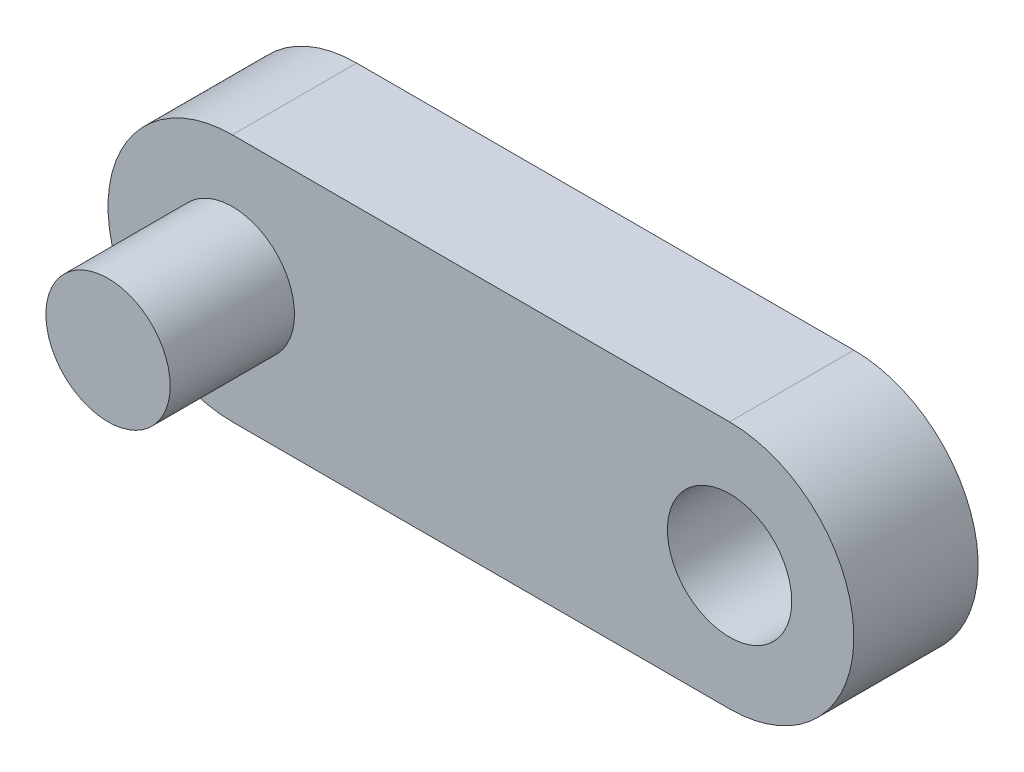
ISO-10303-21;
HEADER;
FILE_DESCRIPTION(('STEP AP214'),'2;1');
FILE_NAME('part.step','',(''),(''),'','','');
FILE_SCHEMA(('AUTOMOTIVE_DESIGN { 1 0 10303 214 1 1 1 1 }'));
ENDSEC;
DATA;
#1=APPLICATION_CONTEXT('core data for automotive mechanical design processes');
#2=APPLICATION_PROTOCOL_DEFINITION('international standard','automotive_design',2000,#1);
#3=PRODUCT_CONTEXT('',#1,'mechanical');
#4=PRODUCT('Part','Part','',(#3));
#5=PRODUCT_RELATED_PRODUCT_CATEGORY('part','',(#4));
#6=PRODUCT_DEFINITION_FORMATION('','',#4);
#7=PRODUCT_DEFINITION_CONTEXT('part definition',#1,'design');
#8=PRODUCT_DEFINITION('design','',#6,#7);
#9=PRODUCT_DEFINITION_SHAPE('','',#8);
#10=(LENGTH_UNIT() NAMED_UNIT(*) SI_UNIT(.MILLI.,.METRE.));
#11=(NAMED_UNIT(*) PLANE_ANGLE_UNIT() SI_UNIT($,.RADIAN.));
#12=(NAMED_UNIT(*) SI_UNIT($,.STERADIAN.) SOLID_ANGLE_UNIT());
#13=UNCERTAINTY_MEASURE_WITH_UNIT(LENGTH_MEASURE(1.E-05),#10,'distance_accuracy_value','');
#14=(GEOMETRIC_REPRESENTATION_CONTEXT(3) GLOBAL_UNCERTAINTY_ASSIGNED_CONTEXT((#13)) GLOBAL_UNIT_ASSIGNED_CONTEXT((#10,
#11,#12)) REPRESENTATION_CONTEXT('',''));
#15=CARTESIAN_POINT('',(0.,0.,0.));
#16=DIRECTION('',(0.,0.,1.));
#17=DIRECTION('',(1.,0.,0.));
#18=AXIS2_PLACEMENT_3D('',#15,#16,#17);
#19=CARTESIAN_POINT('',(-10.,0.,5.));
#20=DIRECTION('',(0.,0.,1.));
#21=DIRECTION('',(1.,0.,0.));
#22=AXIS2_PLACEMENT_3D('',#19,#20,#21);
#23=PLANE('',#22);
#24=CARTESIAN_POINT('',(-10.,0.,5.));
#25=DIRECTION('',(0.,0.,1.));
#26=DIRECTION('',(1.,0.,0.));
#27=AXIS2_PLACEMENT_3D('',#24,#25,#26);
#28=CIRCLE('',#27,2.5);
#29=CARTESIAN_POINT('',(-7.5,0.,5.));
#30=VERTEX_POINT('',#29);
#31=EDGE_CURVE('E100',#30,#30,#28,.T.);
#32=ORIENTED_EDGE('',*,*,#31,.F.);
#33=EDGE_LOOP('',(#32));
#34=FACE_BOUND('',#33,.T.);
#35=CARTESIAN_POINT('',(-10.,0.,5.));
#36=DIRECTION('',(0.,0.,1.));
#37=DIRECTION('',(1.,0.,0.));
#38=AXIS2_PLACEMENT_3D('',#35,#36,#37);
#39=CIRCLE('',#38,5.);
#40=CARTESIAN_POINT('',(-10.,5.,5.));
#41=VERTEX_POINT('',#40);
#42=CARTESIAN_POINT('',(-10.,-5.,5.));
#43=VERTEX_POINT('',#42);
#44=EDGE_CURVE('E85',#41,#43,#39,.T.);
#45=ORIENTED_EDGE('',*,*,#44,.T.);
#46=DIRECTION('',(1.,0.,0.));
#47=VECTOR('',#46,1.);
#48=CARTESIAN_POINT('',(-10.,-5.,5.));
#49=LINE('',#48,#47);
#50=CARTESIAN_POINT('',(10.,-5.,5.));
#51=VERTEX_POINT('',#50);
#52=EDGE_CURVE('E80',#43,#51,#49,.T.);
#53=ORIENTED_EDGE('',*,*,#52,.T.);
#54=CARTESIAN_POINT('',(10.,0.,5.));
#55=DIRECTION('',(0.,0.,1.));
#56=DIRECTION('',(1.,0.,0.));
#57=AXIS2_PLACEMENT_3D('',#54,#55,#56);
#58=CIRCLE('',#57,5.);
#59=CARTESIAN_POINT('',(10.,5.,5.));
#60=VERTEX_POINT('',#59);
#61=EDGE_CURVE('E83',#51,#60,#58,.T.);
#62=ORIENTED_EDGE('',*,*,#61,.T.);
#63=DIRECTION('',(-1.,0.,0.));
#64=VECTOR('',#63,1.);
#65=CARTESIAN_POINT('',(-10.,5.,5.));
#66=LINE('',#65,#64);
#67=EDGE_CURVE('E50',#60,#41,#66,.T.);
#68=ORIENTED_EDGE('',*,*,#67,.T.);
#69=EDGE_LOOP('',(#45,#53,#62,#68));
#70=FACE_BOUND('',#69,.T.);
#71=CARTESIAN_POINT('',(10.,0.,5.));
#72=DIRECTION('',(0.,0.,1.));
#73=DIRECTION('',(1.,0.,0.));
#74=AXIS2_PLACEMENT_3D('',#71,#72,#73);
#75=CIRCLE('',#74,2.5);
#76=CARTESIAN_POINT('',(12.5,0.,5.));
#77=VERTEX_POINT('',#76);
#78=EDGE_CURVE('E114',#77,#77,#75,.T.);
#79=ORIENTED_EDGE('',*,*,#78,.F.);
#80=EDGE_LOOP('',(#79));
#81=FACE_BOUND('',#80,.T.);
#82=ADVANCED_FACE('F33',(#34,#70,#81),#23,.T.);
#83=CARTESIAN_POINT('',(-10.,0.,0.));
#84=DIRECTION('',(0.,0.,1.));
#85=DIRECTION('',(1.,0.,0.));
#86=AXIS2_PLACEMENT_3D('',#83,#84,#85);
#87=PLANE('',#86);
#88=CARTESIAN_POINT('',(-10.,0.,0.));
#89=DIRECTION('',(0.,0.,1.));
#90=DIRECTION('',(1.,0.,0.));
#91=AXIS2_PLACEMENT_3D('',#88,#89,#90);
#92=CIRCLE('',#91,5.);
#93=CARTESIAN_POINT('',(-10.,5.,0.));
#94=VERTEX_POINT('',#93);
#95=CARTESIAN_POINT('',(-10.,-5.,0.));
#96=VERTEX_POINT('',#95);
#97=EDGE_CURVE('E97',#94,#96,#92,.T.);
#98=ORIENTED_EDGE('',*,*,#97,.F.);
#99=DIRECTION('',(-1.,0.,0.));
#100=VECTOR('',#99,1.);
#101=CARTESIAN_POINT('',(-10.,5.,0.));
#102=LINE('',#101,#100);
#103=CARTESIAN_POINT('',(10.,5.,0.));
#104=VERTEX_POINT('',#103);
#105=EDGE_CURVE('E73',#104,#94,#102,.T.);
#106=ORIENTED_EDGE('',*,*,#105,.F.);
#107=CARTESIAN_POINT('',(10.,0.,0.));
#108=DIRECTION('',(0.,0.,1.));
#109=DIRECTION('',(1.,0.,0.));
#110=AXIS2_PLACEMENT_3D('',#107,#108,#109);
#111=CIRCLE('',#110,5.);
#112=CARTESIAN_POINT('',(10.,-5.,0.));
#113=VERTEX_POINT('',#112);
#114=EDGE_CURVE('E67',#113,#104,#111,.T.);
#115=ORIENTED_EDGE('',*,*,#114,.F.);
#116=DIRECTION('',(1.,0.,0.));
#117=VECTOR('',#116,1.);
#118=CARTESIAN_POINT('',(-10.,-5.,0.));
#119=LINE('',#118,#117);
#120=EDGE_CURVE('E89',#96,#113,#119,.T.);
#121=ORIENTED_EDGE('',*,*,#120,.F.);
#122=EDGE_LOOP('',(#98,#106,#115,#121));
#123=FACE_BOUND('',#122,.T.);
#124=CARTESIAN_POINT('',(10.,0.,0.));
#125=DIRECTION('',(0.,0.,1.));
#126=DIRECTION('',(1.,0.,0.));
#127=AXIS2_PLACEMENT_3D('',#124,#125,#126);
#128=CIRCLE('',#127,2.5);
#129=CARTESIAN_POINT('',(12.5,0.,0.));
#130=VERTEX_POINT('',#129);
#131=EDGE_CURVE('E115',#130,#130,#128,.T.);
#132=ORIENTED_EDGE('',*,*,#131,.T.);
#133=EDGE_LOOP('',(#132));
#134=FACE_BOUND('',#133,.T.);
#135=ADVANCED_FACE('F108',(#123,#134),#87,.F.);
#136=CARTESIAN_POINT('',(-10.,0.,5.));
#137=DIRECTION('',(0.,0.,-1.));
#138=DIRECTION('',(-1.,0.,0.));
#139=AXIS2_PLACEMENT_3D('',#136,#137,#138);
#140=CYLINDRICAL_SURFACE('',#139,5.);
#141=ORIENTED_EDGE('',*,*,#97,.T.);
#142=DIRECTION('',(0.,0.,-1.));
#143=VECTOR('',#142,1.);
#144=CARTESIAN_POINT('',(-10.,-5.,5.));
#145=LINE('',#144,#143);
#146=EDGE_CURVE('E11',#43,#96,#145,.T.);
#147=ORIENTED_EDGE('',*,*,#146,.F.);
#148=ORIENTED_EDGE('',*,*,#44,.F.);
#149=DIRECTION('',(0.,0.,-1.));
#150=VECTOR('',#149,1.);
#151=CARTESIAN_POINT('',(-10.,5.,5.));
#152=LINE('',#151,#150);
#153=EDGE_CURVE('E93',#41,#94,#152,.T.);
#154=ORIENTED_EDGE('',*,*,#153,.T.);
#155=EDGE_LOOP('',(#141,#147,#148,#154));
#156=FACE_BOUND('',#155,.T.);
#157=ADVANCED_FACE('F35',(#156),#140,.T.);
#158=CARTESIAN_POINT('',(-10.,-5.,5.));
#159=DIRECTION('',(0.,1.,0.));
#160=DIRECTION('',(-1.,0.,0.));
#161=AXIS2_PLACEMENT_3D('',#158,#159,#160);
#162=PLANE('',#161);
#163=ORIENTED_EDGE('',*,*,#120,.T.);
#164=DIRECTION('',(0.,0.,-1.));
#165=VECTOR('',#164,1.);
#166=CARTESIAN_POINT('',(10.,-5.,5.));
#167=LINE('',#166,#165);
#168=EDGE_CURVE('E42',#51,#113,#167,.T.);
#169=ORIENTED_EDGE('',*,*,#168,.F.);
#170=ORIENTED_EDGE('',*,*,#52,.F.);
#171=ORIENTED_EDGE('',*,*,#146,.T.);
#172=EDGE_LOOP('',(#163,#169,#170,#171));
#173=FACE_BOUND('',#172,.T.);
#174=ADVANCED_FACE('F88',(#173),#162,.F.);
#175=CARTESIAN_POINT('',(10.,0.,5.));
#176=DIRECTION('',(0.,0.,-1.));
#177=DIRECTION('',(-1.,0.,0.));
#178=AXIS2_PLACEMENT_3D('',#175,#176,#177);
#179=CYLINDRICAL_SURFACE('',#178,5.);
#180=ORIENTED_EDGE('',*,*,#114,.T.);
#181=DIRECTION('',(0.,0.,-1.));
#182=VECTOR('',#181,1.);
#183=CARTESIAN_POINT('',(10.,5.,5.));
#184=LINE('',#183,#182);
#185=EDGE_CURVE('E90',#60,#104,#184,.T.);
#186=ORIENTED_EDGE('',*,*,#185,.F.);
#187=ORIENTED_EDGE('',*,*,#61,.F.);
#188=ORIENTED_EDGE('',*,*,#168,.T.);
#189=EDGE_LOOP('',(#180,#186,#187,#188));
#190=FACE_BOUND('',#189,.T.);
#191=ADVANCED_FACE('F91',(#190),#179,.T.);
#192=CARTESIAN_POINT('',(-10.,5.,5.));
#193=DIRECTION('',(0.,-1.,0.));
#194=DIRECTION('',(1.,0.,0.));
#195=AXIS2_PLACEMENT_3D('',#192,#193,#194);
#196=PLANE('',#195);
#197=ORIENTED_EDGE('',*,*,#105,.T.);
#198=ORIENTED_EDGE('',*,*,#153,.F.);
#199=ORIENTED_EDGE('',*,*,#67,.F.);
#200=ORIENTED_EDGE('',*,*,#185,.T.);
#201=EDGE_LOOP('',(#197,#198,#199,#200));
#202=FACE_BOUND('',#201,.T.);
#203=ADVANCED_FACE('F105',(#202),#196,.F.);
#204=CARTESIAN_POINT('',(10.,0.,5.));
#205=DIRECTION('',(0.,0.,-1.));
#206=DIRECTION('',(-1.,0.,0.));
#207=AXIS2_PLACEMENT_3D('',#204,#205,#206);
#208=CYLINDRICAL_SURFACE('',#207,2.5);
#209=ORIENTED_EDGE('',*,*,#78,.T.);
#210=EDGE_LOOP('',(#209));
#211=FACE_BOUND('',#210,.T.);
#212=ORIENTED_EDGE('',*,*,#131,.F.);
#213=EDGE_LOOP('',(#212));
#214=FACE_BOUND('',#213,.T.);
#215=ADVANCED_FACE('F128',(#211,#214),#208,.F.);
#216=CARTESIAN_POINT('',(-10.,0.,10.));
#217=DIRECTION('',(0.,0.,-1.));
#218=DIRECTION('',(-1.,0.,0.));
#219=AXIS2_PLACEMENT_3D('',#216,#217,#218);
#220=CYLINDRICAL_SURFACE('',#219,2.5);
#221=ORIENTED_EDGE('',*,*,#31,.T.);
#222=EDGE_LOOP('',(#221));
#223=FACE_BOUND('',#222,.T.);
#224=CARTESIAN_POINT('',(-10.,0.,10.));
#225=DIRECTION('',(0.,0.,1.));
#226=DIRECTION('',(1.,0.,0.));
#227=AXIS2_PLACEMENT_3D('',#224,#225,#226);
#228=CIRCLE('',#227,2.5);
#229=CARTESIAN_POINT('',(-7.5,0.,10.));
#230=VERTEX_POINT('',#229);
#231=EDGE_CURVE('E118',#230,#230,#228,.T.);
#232=ORIENTED_EDGE('',*,*,#231,.F.);
#233=EDGE_LOOP('',(#232));
#234=FACE_BOUND('',#233,.T.);
#235=ADVANCED_FACE('F126',(#223,#234),#220,.T.);
#236=CARTESIAN_POINT('',(0.,0.,10.));
#237=DIRECTION('',(0.,0.,1.));
#238=DIRECTION('',(1.,0.,0.));
#239=AXIS2_PLACEMENT_3D('',#236,#237,#238);
#240=PLANE('',#239);
#241=ORIENTED_EDGE('',*,*,#231,.T.);
#242=EDGE_LOOP('',(#241));
#243=FACE_BOUND('',#242,.T.);
#244=ADVANCED_FACE('F124',(#243),#240,.T.);
#245=CLOSED_SHELL('',(#82,#135,#157,#174,#191,#203,#215,#235,#244));
#246=MANIFOLD_SOLID_BREP('B2',#245);
#247=ADVANCED_BREP_SHAPE_REPRESENTATION('',(#18,#246),#14);
#248=SHAPE_DEFINITION_REPRESENTATION(#9,#247);
ENDSEC;
END-ISO-10303-21;
